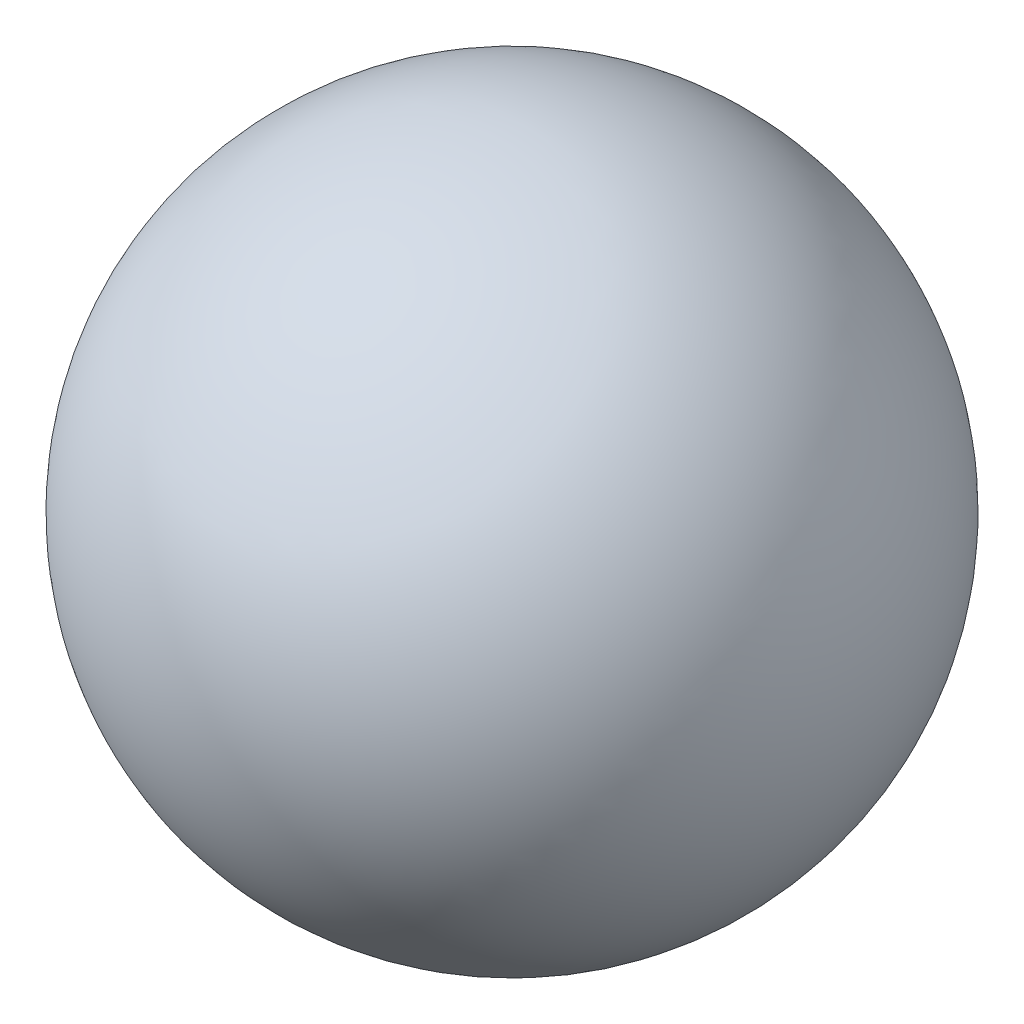
ISO-10303-21;
HEADER;
FILE_DESCRIPTION(('STEP AP214'),'2;1');
FILE_NAME('part.step','',(''),(''),'','','');
FILE_SCHEMA(('AUTOMOTIVE_DESIGN { 1 0 10303 214 1 1 1 1 }'));
ENDSEC;
DATA;
#1=APPLICATION_CONTEXT('core data for automotive mechanical design processes');
#2=APPLICATION_PROTOCOL_DEFINITION('international standard','automotive_design',2000,#1);
#3=PRODUCT_CONTEXT('',#1,'mechanical');
#4=PRODUCT('Part','Part','',(#3));
#5=PRODUCT_RELATED_PRODUCT_CATEGORY('part','',(#4));
#6=PRODUCT_DEFINITION_FORMATION('','',#4);
#7=PRODUCT_DEFINITION_CONTEXT('part definition',#1,'design');
#8=PRODUCT_DEFINITION('design','',#6,#7);
#9=PRODUCT_DEFINITION_SHAPE('','',#8);
#10=(LENGTH_UNIT() NAMED_UNIT(*) SI_UNIT(.MILLI.,.METRE.));
#11=(NAMED_UNIT(*) PLANE_ANGLE_UNIT() SI_UNIT($,.RADIAN.));
#12=(NAMED_UNIT(*) SI_UNIT($,.STERADIAN.) SOLID_ANGLE_UNIT());
#13=UNCERTAINTY_MEASURE_WITH_UNIT(LENGTH_MEASURE(1.E-05),#10,'distance_accuracy_value','');
#14=(GEOMETRIC_REPRESENTATION_CONTEXT(3) GLOBAL_UNCERTAINTY_ASSIGNED_CONTEXT((#13)) GLOBAL_UNIT_ASSIGNED_CONTEXT((#10,
#11,#12)) REPRESENTATION_CONTEXT('',''));
#15=CARTESIAN_POINT('',(0.,0.,0.));
#16=DIRECTION('',(0.,0.,1.));
#17=DIRECTION('',(1.,0.,0.));
#18=AXIS2_PLACEMENT_3D('',#15,#16,#17);
#19=CARTESIAN_POINT('',(-4.36703385400885,-2.,10.9083232129389));
#20=DIRECTION('',(0.,0.,1.));
#21=DIRECTION('',(1.,0.,0.));
#22=AXIS2_PLACEMENT_3D('',#19,#20,#21);
#23=SPHERICAL_SURFACE('',#22,1.05);
#24=CARTESIAN_POINT('',(-4.36703385400885,-2.,11.9583232129389));
#25=VERTEX_POINT('',#24);
#26=VERTEX_LOOP('',#25);
#27=FACE_BOUND('',#26,.T.);
#28=ADVANCED_FACE('F13',(#27),#23,.T.);
#29=CLOSED_SHELL('',(#28));
#30=MANIFOLD_SOLID_BREP('B1',#29);
#31=ADVANCED_BREP_SHAPE_REPRESENTATION('',(#18,#30),#14);
#32=SHAPE_DEFINITION_REPRESENTATION(#9,#31);
ENDSEC;
END-ISO-10303-21;
